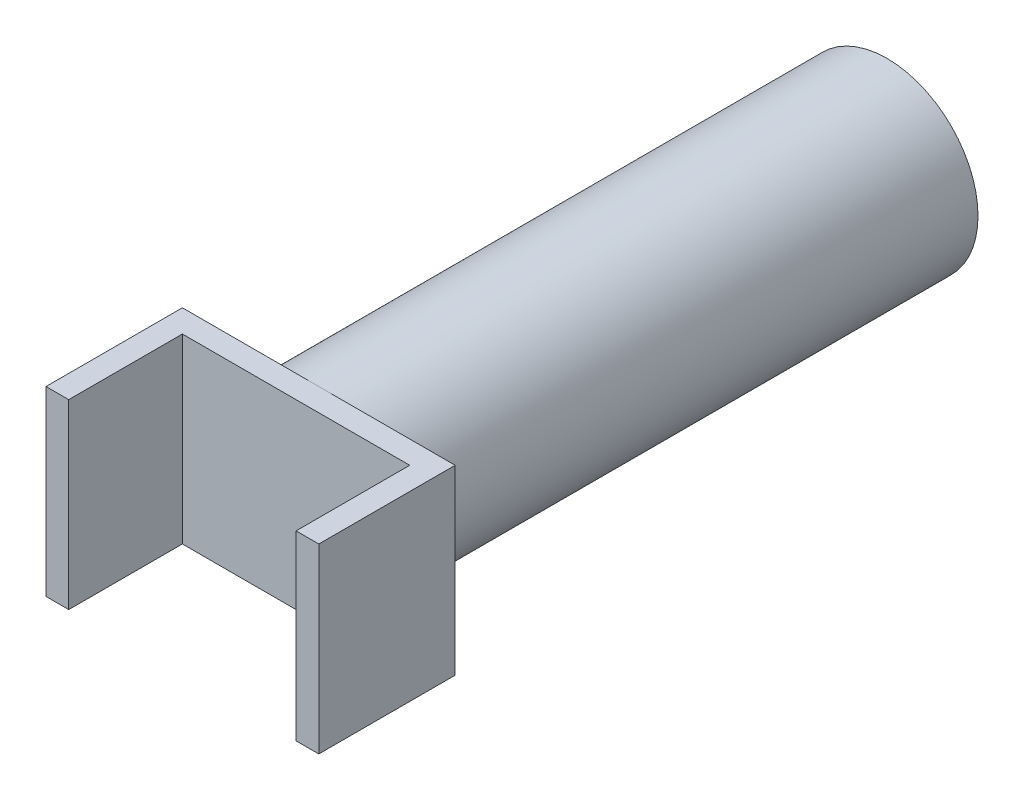
ISO-10303-21;
HEADER;
FILE_DESCRIPTION(('STEP AP214'),'2;1');
FILE_NAME('part.step','',(''),(''),'','','');
FILE_SCHEMA(('AUTOMOTIVE_DESIGN { 1 0 10303 214 1 1 1 1 }'));
ENDSEC;
DATA;
#1=APPLICATION_CONTEXT('core data for automotive mechanical design processes');
#2=APPLICATION_PROTOCOL_DEFINITION('international standard','automotive_design',2000,#1);
#3=PRODUCT_CONTEXT('',#1,'mechanical');
#4=PRODUCT('Part','Part','',(#3));
#5=PRODUCT_RELATED_PRODUCT_CATEGORY('part','',(#4));
#6=PRODUCT_DEFINITION_FORMATION('','',#4);
#7=PRODUCT_DEFINITION_CONTEXT('part definition',#1,'design');
#8=PRODUCT_DEFINITION('design','',#6,#7);
#9=PRODUCT_DEFINITION_SHAPE('','',#8);
#10=(LENGTH_UNIT() NAMED_UNIT(*) SI_UNIT(.MILLI.,.METRE.));
#11=(NAMED_UNIT(*) PLANE_ANGLE_UNIT() SI_UNIT($,.RADIAN.));
#12=(NAMED_UNIT(*) SI_UNIT($,.STERADIAN.) SOLID_ANGLE_UNIT());
#13=UNCERTAINTY_MEASURE_WITH_UNIT(LENGTH_MEASURE(1.E-05),#10,'distance_accuracy_value','');
#14=(GEOMETRIC_REPRESENTATION_CONTEXT(3) GLOBAL_UNCERTAINTY_ASSIGNED_CONTEXT((#13)) GLOBAL_UNIT_ASSIGNED_CONTEXT((#10,
#11,#12)) REPRESENTATION_CONTEXT('',''));
#15=CARTESIAN_POINT('',(0.,0.,0.));
#16=DIRECTION('',(0.,0.,1.));
#17=DIRECTION('',(1.,0.,0.));
#18=AXIS2_PLACEMENT_3D('',#15,#16,#17);
#19=CARTESIAN_POINT('',(0.,0.,260.));
#20=DIRECTION('',(0.,0.,-1.));
#21=DIRECTION('',(-1.,0.,0.));
#22=AXIS2_PLACEMENT_3D('',#19,#20,#21);
#23=PLANE('',#22);
#24=DIRECTION('',(0.,-1.,0.));
#25=VECTOR('',#24,1.);
#26=CARTESIAN_POINT('',(50.,40.,260.));
#27=LINE('',#26,#25);
#28=CARTESIAN_POINT('',(50.,40.,260.));
#29=VERTEX_POINT('',#28);
#30=CARTESIAN_POINT('',(50.,-40.,260.));
#31=VERTEX_POINT('',#30);
#32=EDGE_CURVE('E123',#29,#31,#27,.T.);
#33=ORIENTED_EDGE('',*,*,#32,.F.);
#34=DIRECTION('',(-1.,0.,0.));
#35=VECTOR('',#34,1.);
#36=CARTESIAN_POINT('',(60.,40.,260.));
#37=LINE('',#36,#35);
#38=CARTESIAN_POINT('',(-50.,40.,260.));
#39=VERTEX_POINT('',#38);
#40=EDGE_CURVE('E128',#29,#39,#37,.T.);
#41=ORIENTED_EDGE('',*,*,#40,.T.);
#42=DIRECTION('',(0.,1.,0.));
#43=VECTOR('',#42,1.);
#44=CARTESIAN_POINT('',(-50.,40.,260.));
#45=LINE('',#44,#43);
#46=CARTESIAN_POINT('',(-50.,-40.,260.));
#47=VERTEX_POINT('',#46);
#48=EDGE_CURVE('E53',#47,#39,#45,.T.);
#49=ORIENTED_EDGE('',*,*,#48,.F.);
#50=DIRECTION('',(1.,0.,0.));
#51=VECTOR('',#50,1.);
#52=CARTESIAN_POINT('',(60.,-40.,260.));
#53=LINE('',#52,#51);
#54=EDGE_CURVE('E48',#47,#31,#53,.T.);
#55=ORIENTED_EDGE('',*,*,#54,.T.);
#56=EDGE_LOOP('',(#33,#41,#49,#55));
#57=FACE_BOUND('',#56,.T.);
#58=ADVANCED_FACE('F32',(#57),#23,.F.);
#59=CARTESIAN_POINT('',(0.,0.,250.));
#60=DIRECTION('',(0.,0.,-1.));
#61=DIRECTION('',(-1.,0.,0.));
#62=AXIS2_PLACEMENT_3D('',#59,#60,#61);
#63=CYLINDRICAL_SURFACE('',#62,40.);
#64=CARTESIAN_POINT('',(0.,0.,250.));
#65=DIRECTION('',(0.,0.,1.));
#66=DIRECTION('',(1.,0.,0.));
#67=AXIS2_PLACEMENT_3D('',#64,#65,#66);
#68=CIRCLE('',#67,40.);
#69=CARTESIAN_POINT('',(0.,40.,250.));
#70=VERTEX_POINT('',#69);
#71=CARTESIAN_POINT('',(0.,-40.,250.));
#72=VERTEX_POINT('',#71);
#73=EDGE_CURVE('E11',#70,#72,#68,.T.);
#74=ORIENTED_EDGE('',*,*,#73,.F.);
#75=EDGE_CURVE('E41',#72,#70,#68,.T.);
#76=ORIENTED_EDGE('',*,*,#75,.F.);
#77=EDGE_LOOP('',(#74,#76));
#78=FACE_BOUND('',#77,.T.);
#79=CARTESIAN_POINT('',(0.,0.,0.));
#80=DIRECTION('',(0.,0.,1.));
#81=DIRECTION('',(1.,0.,0.));
#82=AXIS2_PLACEMENT_3D('',#79,#80,#81);
#83=CIRCLE('',#82,40.);
#84=CARTESIAN_POINT('',(40.,0.,0.));
#85=VERTEX_POINT('',#84);
#86=EDGE_CURVE('E36',#85,#85,#83,.T.);
#87=ORIENTED_EDGE('',*,*,#86,.T.);
#88=EDGE_LOOP('',(#87));
#89=FACE_BOUND('',#88,.T.);
#90=ADVANCED_FACE('F34',(#78,#89),#63,.T.);
#91=CARTESIAN_POINT('',(0.,0.,0.));
#92=DIRECTION('',(0.,0.,1.));
#93=DIRECTION('',(1.,0.,0.));
#94=AXIS2_PLACEMENT_3D('',#91,#92,#93);
#95=PLANE('',#94);
#96=ORIENTED_EDGE('',*,*,#86,.F.);
#97=EDGE_LOOP('',(#96));
#98=FACE_BOUND('',#97,.T.);
#99=ADVANCED_FACE('F212',(#98),#95,.F.);
#100=CARTESIAN_POINT('',(0.,0.,250.));
#101=DIRECTION('',(0.,0.,-1.));
#102=DIRECTION('',(-1.,0.,0.));
#103=AXIS2_PLACEMENT_3D('',#100,#101,#102);
#104=PLANE('',#103);
#105=DIRECTION('',(-1.,0.,0.));
#106=VECTOR('',#105,1.);
#107=CARTESIAN_POINT('',(60.,40.,250.));
#108=LINE('',#107,#106);
#109=CARTESIAN_POINT('',(-60.,40.,250.));
#110=VERTEX_POINT('',#109);
#111=EDGE_CURVE('E162',#70,#110,#108,.T.);
#112=ORIENTED_EDGE('',*,*,#111,.F.);
#113=ORIENTED_EDGE('',*,*,#73,.T.);
#114=DIRECTION('',(1.,0.,0.));
#115=VECTOR('',#114,1.);
#116=CARTESIAN_POINT('',(60.,-40.,250.));
#117=LINE('',#116,#115);
#118=CARTESIAN_POINT('',(-60.,-40.,250.));
#119=VERTEX_POINT('',#118);
#120=EDGE_CURVE('E157',#119,#72,#117,.T.);
#121=ORIENTED_EDGE('',*,*,#120,.F.);
#122=DIRECTION('',(0.,-1.,0.));
#123=VECTOR('',#122,1.);
#124=CARTESIAN_POINT('',(-60.,40.,250.));
#125=LINE('',#124,#123);
#126=EDGE_CURVE('E149',#110,#119,#125,.T.);
#127=ORIENTED_EDGE('',*,*,#126,.F.);
#128=EDGE_LOOP('',(#112,#113,#121,#127));
#129=FACE_BOUND('',#128,.T.);
#130=ADVANCED_FACE('F188',(#129),#104,.T.);
#131=CARTESIAN_POINT('',(-60.,40.,260.));
#132=DIRECTION('',(1.,0.,0.));
#133=DIRECTION('',(0.,1.,0.));
#134=AXIS2_PLACEMENT_3D('',#131,#132,#133);
#135=PLANE('',#134);
#136=ORIENTED_EDGE('',*,*,#126,.T.);
#137=DIRECTION('',(0.,0.,-1.));
#138=VECTOR('',#137,1.);
#139=CARTESIAN_POINT('',(-60.,-40.,260.));
#140=LINE('',#139,#138);
#141=CARTESIAN_POINT('',(-60.,-40.,310.));
#142=VERTEX_POINT('',#141);
#143=EDGE_CURVE('E171',#142,#119,#140,.T.);
#144=ORIENTED_EDGE('',*,*,#143,.F.);
#145=DIRECTION('',(0.,-1.,0.));
#146=VECTOR('',#145,1.);
#147=CARTESIAN_POINT('',(-60.,40.,310.));
#148=LINE('',#147,#146);
#149=CARTESIAN_POINT('',(-60.,40.,310.));
#150=VERTEX_POINT('',#149);
#151=EDGE_CURVE('E130',#150,#142,#148,.T.);
#152=ORIENTED_EDGE('',*,*,#151,.F.);
#153=DIRECTION('',(0.,0.,-1.));
#154=VECTOR('',#153,1.);
#155=CARTESIAN_POINT('',(-60.,40.,260.));
#156=LINE('',#155,#154);
#157=EDGE_CURVE('E153',#150,#110,#156,.T.);
#158=ORIENTED_EDGE('',*,*,#157,.T.);
#159=EDGE_LOOP('',(#136,#144,#152,#158));
#160=FACE_BOUND('',#159,.T.);
#161=ADVANCED_FACE('F204',(#160),#135,.F.);
#162=CARTESIAN_POINT('',(60.,-40.,260.));
#163=DIRECTION('',(0.,1.,0.));
#164=DIRECTION('',(-1.,0.,0.));
#165=AXIS2_PLACEMENT_3D('',#162,#163,#164);
#166=PLANE('',#165);
#167=ORIENTED_EDGE('',*,*,#120,.T.);
#168=CARTESIAN_POINT('',(60.,-40.,250.));
#169=VERTEX_POINT('',#168);
#170=EDGE_CURVE('E156',#72,#169,#117,.T.);
#171=ORIENTED_EDGE('',*,*,#170,.T.);
#172=DIRECTION('',(0.,0.,-1.));
#173=VECTOR('',#172,1.);
#174=CARTESIAN_POINT('',(60.,-40.,260.));
#175=LINE('',#174,#173);
#176=CARTESIAN_POINT('',(60.,-40.,310.));
#177=VERTEX_POINT('',#176);
#178=EDGE_CURVE('E168',#177,#169,#175,.T.);
#179=ORIENTED_EDGE('',*,*,#178,.F.);
#180=DIRECTION('',(1.,0.,0.));
#181=VECTOR('',#180,1.);
#182=CARTESIAN_POINT('',(60.,-40.,310.));
#183=LINE('',#182,#181);
#184=CARTESIAN_POINT('',(50.,-40.,310.));
#185=VERTEX_POINT('',#184);
#186=EDGE_CURVE('E113',#185,#177,#183,.T.);
#187=ORIENTED_EDGE('',*,*,#186,.F.);
#188=DIRECTION('',(0.,0.,-1.));
#189=VECTOR('',#188,1.);
#190=CARTESIAN_POINT('',(50.,-40.,310.));
#191=LINE('',#190,#189);
#192=EDGE_CURVE('E109',#185,#31,#191,.T.);
#193=ORIENTED_EDGE('',*,*,#192,.T.);
#194=ORIENTED_EDGE('',*,*,#54,.F.);
#195=DIRECTION('',(0.,0.,-1.));
#196=VECTOR('',#195,1.);
#197=CARTESIAN_POINT('',(-50.,-40.,310.));
#198=LINE('',#197,#196);
#199=CARTESIAN_POINT('',(-50.,-40.,310.));
#200=VERTEX_POINT('',#199);
#201=EDGE_CURVE('E146',#200,#47,#198,.T.);
#202=ORIENTED_EDGE('',*,*,#201,.F.);
#203=DIRECTION('',(1.,0.,0.));
#204=VECTOR('',#203,1.);
#205=CARTESIAN_POINT('',(-60.,-40.,310.));
#206=LINE('',#205,#204);
#207=EDGE_CURVE('E137',#142,#200,#206,.T.);
#208=ORIENTED_EDGE('',*,*,#207,.F.);
#209=ORIENTED_EDGE('',*,*,#143,.T.);
#210=EDGE_LOOP('',(#167,#171,#179,#187,#193,#194,#202,#208,#209));
#211=FACE_BOUND('',#210,.T.);
#212=ADVANCED_FACE('F191',(#211),#166,.F.);
#213=CARTESIAN_POINT('',(60.,40.,260.));
#214=DIRECTION('',(-1.,0.,0.));
#215=DIRECTION('',(0.,-1.,0.));
#216=AXIS2_PLACEMENT_3D('',#213,#214,#215);
#217=PLANE('',#216);
#218=DIRECTION('',(0.,1.,0.));
#219=VECTOR('',#218,1.);
#220=CARTESIAN_POINT('',(60.,40.,250.));
#221=LINE('',#220,#219);
#222=CARTESIAN_POINT('',(60.,40.,250.));
#223=VERTEX_POINT('',#222);
#224=EDGE_CURVE('E160',#169,#223,#221,.T.);
#225=ORIENTED_EDGE('',*,*,#224,.T.);
#226=DIRECTION('',(0.,0.,-1.));
#227=VECTOR('',#226,1.);
#228=CARTESIAN_POINT('',(60.,40.,260.));
#229=LINE('',#228,#227);
#230=CARTESIAN_POINT('',(60.,40.,310.));
#231=VERTEX_POINT('',#230);
#232=EDGE_CURVE('E166',#231,#223,#229,.T.);
#233=ORIENTED_EDGE('',*,*,#232,.F.);
#234=DIRECTION('',(0.,1.,0.));
#235=VECTOR('',#234,1.);
#236=CARTESIAN_POINT('',(60.,40.,310.));
#237=LINE('',#236,#235);
#238=EDGE_CURVE('E120',#177,#231,#237,.T.);
#239=ORIENTED_EDGE('',*,*,#238,.F.);
#240=ORIENTED_EDGE('',*,*,#178,.T.);
#241=EDGE_LOOP('',(#225,#233,#239,#240));
#242=FACE_BOUND('',#241,.T.);
#243=ADVANCED_FACE('F190',(#242),#217,.F.);
#244=CARTESIAN_POINT('',(60.,40.,260.));
#245=DIRECTION('',(0.,-1.,0.));
#246=DIRECTION('',(1.,0.,0.));
#247=AXIS2_PLACEMENT_3D('',#244,#245,#246);
#248=PLANE('',#247);
#249=EDGE_CURVE('E151',#223,#70,#108,.T.);
#250=ORIENTED_EDGE('',*,*,#249,.T.);
#251=ORIENTED_EDGE('',*,*,#111,.T.);
#252=ORIENTED_EDGE('',*,*,#157,.F.);
#253=DIRECTION('',(-1.,0.,0.));
#254=VECTOR('',#253,1.);
#255=CARTESIAN_POINT('',(-60.,40.,310.));
#256=LINE('',#255,#254);
#257=CARTESIAN_POINT('',(-50.,40.,310.));
#258=VERTEX_POINT('',#257);
#259=EDGE_CURVE('E141',#258,#150,#256,.T.);
#260=ORIENTED_EDGE('',*,*,#259,.F.);
#261=DIRECTION('',(0.,0.,-1.));
#262=VECTOR('',#261,1.);
#263=CARTESIAN_POINT('',(-50.,40.,310.));
#264=LINE('',#263,#262);
#265=EDGE_CURVE('E143',#258,#39,#264,.T.);
#266=ORIENTED_EDGE('',*,*,#265,.T.);
#267=ORIENTED_EDGE('',*,*,#40,.F.);
#268=DIRECTION('',(0.,0.,-1.));
#269=VECTOR('',#268,1.);
#270=CARTESIAN_POINT('',(50.,40.,310.));
#271=LINE('',#270,#269);
#272=CARTESIAN_POINT('',(50.,40.,310.));
#273=VERTEX_POINT('',#272);
#274=EDGE_CURVE('E107',#273,#29,#271,.T.);
#275=ORIENTED_EDGE('',*,*,#274,.F.);
#276=DIRECTION('',(-1.,0.,0.));
#277=VECTOR('',#276,1.);
#278=CARTESIAN_POINT('',(60.,40.,310.));
#279=LINE('',#278,#277);
#280=EDGE_CURVE('E114',#231,#273,#279,.T.);
#281=ORIENTED_EDGE('',*,*,#280,.F.);
#282=ORIENTED_EDGE('',*,*,#232,.T.);
#283=EDGE_LOOP('',(#250,#251,#252,#260,#266,#267,#275,#281,#282));
#284=FACE_BOUND('',#283,.T.);
#285=ADVANCED_FACE('F126',(#284),#248,.F.);
#286=ORIENTED_EDGE('',*,*,#170,.F.);
#287=ORIENTED_EDGE('',*,*,#75,.T.);
#288=ORIENTED_EDGE('',*,*,#249,.F.);
#289=ORIENTED_EDGE('',*,*,#224,.F.);
#290=EDGE_LOOP('',(#286,#287,#288,#289));
#291=FACE_BOUND('',#290,.T.);
#292=ADVANCED_FACE('F183',(#291),#104,.T.);
#293=CARTESIAN_POINT('',(-50.,40.,310.));
#294=DIRECTION('',(-1.,0.,0.));
#295=DIRECTION('',(0.,-1.,0.));
#296=AXIS2_PLACEMENT_3D('',#293,#294,#295);
#297=PLANE('',#296);
#298=ORIENTED_EDGE('',*,*,#48,.T.);
#299=ORIENTED_EDGE('',*,*,#265,.F.);
#300=DIRECTION('',(0.,1.,0.));
#301=VECTOR('',#300,1.);
#302=CARTESIAN_POINT('',(-50.,40.,310.));
#303=LINE('',#302,#301);
#304=EDGE_CURVE('E139',#200,#258,#303,.T.);
#305=ORIENTED_EDGE('',*,*,#304,.F.);
#306=ORIENTED_EDGE('',*,*,#201,.T.);
#307=EDGE_LOOP('',(#298,#299,#305,#306));
#308=FACE_BOUND('',#307,.T.);
#309=ADVANCED_FACE('F197',(#308),#297,.F.);
#310=CARTESIAN_POINT('',(0.,0.,310.));
#311=DIRECTION('',(0.,0.,1.));
#312=DIRECTION('',(1.,0.,0.));
#313=AXIS2_PLACEMENT_3D('',#310,#311,#312);
#314=PLANE('',#313);
#315=ORIENTED_EDGE('',*,*,#151,.T.);
#316=ORIENTED_EDGE('',*,*,#207,.T.);
#317=ORIENTED_EDGE('',*,*,#304,.T.);
#318=ORIENTED_EDGE('',*,*,#259,.T.);
#319=EDGE_LOOP('',(#315,#316,#317,#318));
#320=FACE_BOUND('',#319,.T.);
#321=ADVANCED_FACE('F201',(#320),#314,.T.);
#322=CARTESIAN_POINT('',(50.,40.,310.));
#323=DIRECTION('',(1.,0.,0.));
#324=DIRECTION('',(0.,1.,0.));
#325=AXIS2_PLACEMENT_3D('',#322,#323,#324);
#326=PLANE('',#325);
#327=ORIENTED_EDGE('',*,*,#32,.T.);
#328=ORIENTED_EDGE('',*,*,#192,.F.);
#329=DIRECTION('',(0.,-1.,0.));
#330=VECTOR('',#329,1.);
#331=CARTESIAN_POINT('',(50.,40.,310.));
#332=LINE('',#331,#330);
#333=EDGE_CURVE('E103',#273,#185,#332,.T.);
#334=ORIENTED_EDGE('',*,*,#333,.F.);
#335=ORIENTED_EDGE('',*,*,#274,.T.);
#336=EDGE_LOOP('',(#327,#328,#334,#335));
#337=FACE_BOUND('',#336,.T.);
#338=ADVANCED_FACE('F105',(#337),#326,.F.);
#339=CARTESIAN_POINT('',(0.,0.,310.));
#340=DIRECTION('',(0.,0.,1.));
#341=DIRECTION('',(1.,0.,0.));
#342=AXIS2_PLACEMENT_3D('',#339,#340,#341);
#343=PLANE('',#342);
#344=ORIENTED_EDGE('',*,*,#280,.T.);
#345=ORIENTED_EDGE('',*,*,#333,.T.);
#346=ORIENTED_EDGE('',*,*,#186,.T.);
#347=ORIENTED_EDGE('',*,*,#238,.T.);
#348=EDGE_LOOP('',(#344,#345,#346,#347));
#349=FACE_BOUND('',#348,.T.);
#350=ADVANCED_FACE('F118',(#349),#343,.T.);
#351=CLOSED_SHELL('',(#58,#90,#99,#130,#161,#212,#243,#285,#292,#309,#321,#338,#350));
#352=MANIFOLD_SOLID_BREP('B2',#351);
#353=ADVANCED_BREP_SHAPE_REPRESENTATION('',(#18,#352),#14);
#354=SHAPE_DEFINITION_REPRESENTATION(#9,#353);
ENDSEC;
END-ISO-10303-21;
